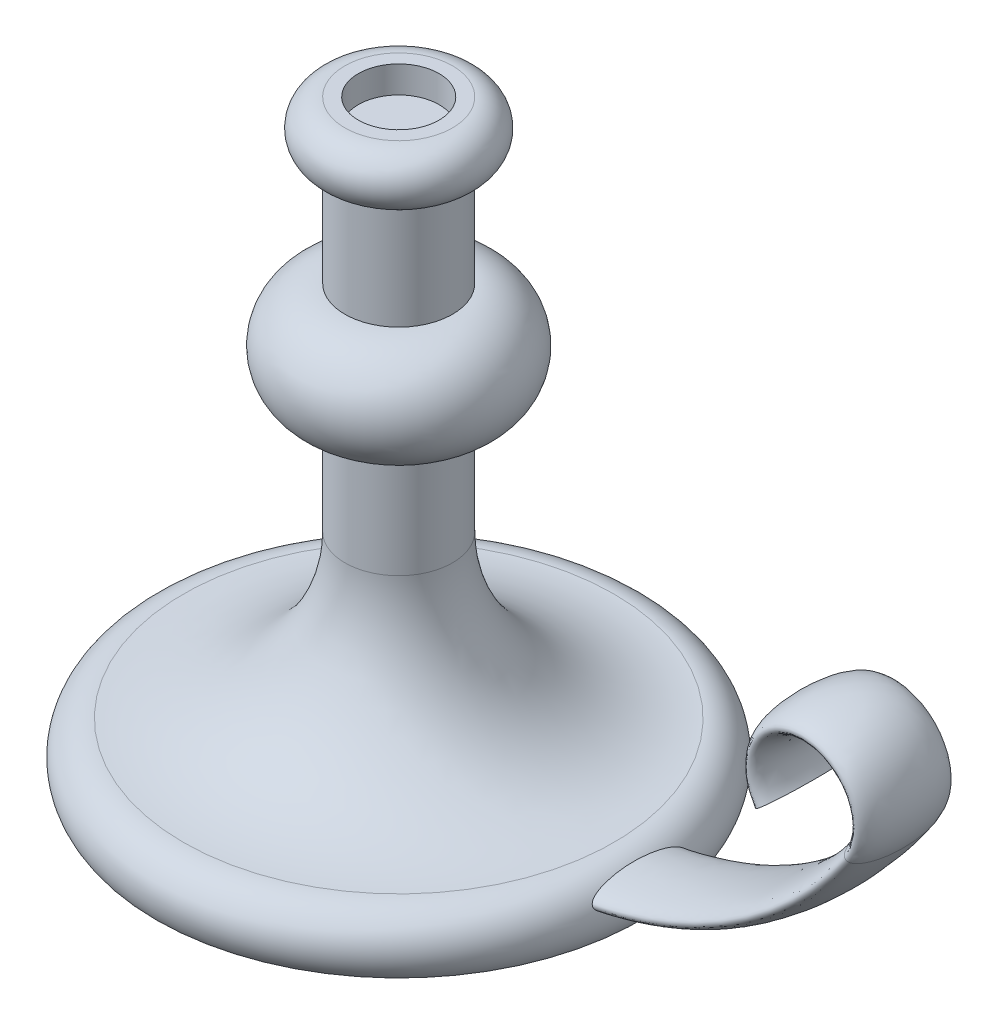
ISO-10303-21;
HEADER;
FILE_DESCRIPTION(('STEP AP214'),'2;1');
FILE_NAME('part.step','',(''),(''),'','','');
FILE_SCHEMA(('AUTOMOTIVE_DESIGN { 1 0 10303 214 1 1 1 1 }'));
ENDSEC;
DATA;
#1=APPLICATION_CONTEXT('core data for automotive mechanical design processes');
#2=APPLICATION_PROTOCOL_DEFINITION('international standard','automotive_design',2000,#1);
#3=PRODUCT_CONTEXT('',#1,'mechanical');
#4=PRODUCT('Part','Part','',(#3));
#5=PRODUCT_RELATED_PRODUCT_CATEGORY('part','',(#4));
#6=PRODUCT_DEFINITION_FORMATION('','',#4);
#7=PRODUCT_DEFINITION_CONTEXT('part definition',#1,'design');
#8=PRODUCT_DEFINITION('design','',#6,#7);
#9=PRODUCT_DEFINITION_SHAPE('','',#8);
#10=(LENGTH_UNIT() NAMED_UNIT(*) SI_UNIT(.MILLI.,.METRE.));
#11=(NAMED_UNIT(*) PLANE_ANGLE_UNIT() SI_UNIT($,.RADIAN.));
#12=(NAMED_UNIT(*) SI_UNIT($,.STERADIAN.) SOLID_ANGLE_UNIT());
#13=UNCERTAINTY_MEASURE_WITH_UNIT(LENGTH_MEASURE(1.E-05),#10,'distance_accuracy_value','');
#14=(GEOMETRIC_REPRESENTATION_CONTEXT(3) GLOBAL_UNCERTAINTY_ASSIGNED_CONTEXT((#13)) GLOBAL_UNIT_ASSIGNED_CONTEXT((#10,
#11,#12)) REPRESENTATION_CONTEXT('',''));
#15=CARTESIAN_POINT('',(0.,0.,0.));
#16=DIRECTION('',(0.,0.,1.));
#17=DIRECTION('',(1.,0.,0.));
#18=AXIS2_PLACEMENT_3D('',#15,#16,#17);
#19=CARTESIAN_POINT('',(0.,220.,0.));
#20=DIRECTION('',(0.,1.,0.));
#21=DIRECTION('',(0.,0.,1.));
#22=AXIS2_PLACEMENT_3D('',#19,#20,#21);
#23=PLANE('',#22);
#24=CARTESIAN_POINT('',(0.,220.,0.));
#25=DIRECTION('',(0.,1.,0.));
#26=DIRECTION('',(0.,0.,1.));
#27=AXIS2_PLACEMENT_3D('',#24,#25,#26);
#28=CIRCLE('',#27,15.);
#29=CARTESIAN_POINT('',(0.,220.,15.));
#30=VERTEX_POINT('',#29);
#31=EDGE_CURVE('E74',#30,#30,#28,.T.);
#32=ORIENTED_EDGE('',*,*,#31,.F.);
#33=EDGE_LOOP('',(#32));
#34=FACE_BOUND('',#33,.T.);
#35=CARTESIAN_POINT('',(0.,220.,0.));
#36=DIRECTION('',(0.,-1.,0.));
#37=DIRECTION('',(0.,0.,-1.));
#38=AXIS2_PLACEMENT_3D('',#35,#36,#37);
#39=CIRCLE('',#38,20.);
#40=CARTESIAN_POINT('',(0.,220.,-20.));
#41=VERTEX_POINT('',#40);
#42=EDGE_CURVE('E42',#41,#41,#39,.T.);
#43=ORIENTED_EDGE('',*,*,#42,.F.);
#44=EDGE_LOOP('',(#43));
#45=FACE_BOUND('',#44,.T.);
#46=ADVANCED_FACE('F31',(#34,#45),#23,.T.);
#47=CARTESIAN_POINT('',(0.,210.,0.));
#48=DIRECTION('',(0.,-1.,0.));
#49=DIRECTION('',(0.,0.,-1.));
#50=AXIS2_PLACEMENT_3D('',#47,#48,#49);
#51=TOROIDAL_SURFACE('',#50,20.,9.99999999999999);
#52=ORIENTED_EDGE('',*,*,#42,.T.);
#53=EDGE_LOOP('',(#52));
#54=FACE_BOUND('',#53,.T.);
#55=CARTESIAN_POINT('',(0.,200.,0.));
#56=DIRECTION('',(0.,-1.,0.));
#57=DIRECTION('',(0.,0.,-1.));
#58=AXIS2_PLACEMENT_3D('',#55,#56,#57);
#59=CIRCLE('',#58,20.);
#60=CARTESIAN_POINT('',(0.,200.,-20.));
#61=VERTEX_POINT('',#60);
#62=EDGE_CURVE('E46',#61,#61,#59,.T.);
#63=ORIENTED_EDGE('',*,*,#62,.F.);
#64=EDGE_LOOP('',(#63));
#65=FACE_BOUND('',#64,.T.);
#66=ADVANCED_FACE('F92',(#54,#65),#51,.T.);
#67=CARTESIAN_POINT('',(0.,0.,0.));
#68=DIRECTION('',(0.,-1.,0.));
#69=DIRECTION('',(0.,0.,-1.));
#70=AXIS2_PLACEMENT_3D('',#67,#68,#69);
#71=CYLINDRICAL_SURFACE('',#70,20.);
#72=ORIENTED_EDGE('',*,*,#62,.T.);
#73=EDGE_LOOP('',(#72));
#74=FACE_BOUND('',#73,.T.);
#75=CARTESIAN_POINT('',(0.,160.,0.));
#76=DIRECTION('',(0.,-1.,0.));
#77=DIRECTION('',(0.,0.,-1.));
#78=AXIS2_PLACEMENT_3D('',#75,#76,#77);
#79=CIRCLE('',#78,20.);
#80=CARTESIAN_POINT('',(0.,160.,-20.));
#81=VERTEX_POINT('',#80);
#82=EDGE_CURVE('E50',#81,#81,#79,.T.);
#83=ORIENTED_EDGE('',*,*,#82,.F.);
#84=EDGE_LOOP('',(#83));
#85=FACE_BOUND('',#84,.T.);
#86=ADVANCED_FACE('F96',(#74,#85),#71,.T.);
#87=CARTESIAN_POINT('',(0.,140.,0.));
#88=DIRECTION('',(0.,-1.,0.));
#89=DIRECTION('',(0.,0.,-1.));
#90=AXIS2_PLACEMENT_3D('',#87,#88,#89);
#91=DEGENERATE_TOROIDAL_SURFACE('',#90,20.,20.,.T.);
#92=ORIENTED_EDGE('',*,*,#82,.T.);
#93=EDGE_LOOP('',(#92));
#94=FACE_BOUND('',#93,.T.);
#95=CARTESIAN_POINT('',(0.,120.,0.));
#96=DIRECTION('',(0.,-1.,0.));
#97=DIRECTION('',(0.,0.,-1.));
#98=AXIS2_PLACEMENT_3D('',#95,#96,#97);
#99=CIRCLE('',#98,20.);
#100=CARTESIAN_POINT('',(0.,120.,-20.));
#101=VERTEX_POINT('',#100);
#102=EDGE_CURVE('E55',#101,#101,#99,.T.);
#103=ORIENTED_EDGE('',*,*,#102,.F.);
#104=EDGE_LOOP('',(#103));
#105=FACE_BOUND('',#104,.T.);
#106=ADVANCED_FACE('F100',(#94,#105),#91,.T.);
#107=CARTESIAN_POINT('',(0.,0.,0.));
#108=DIRECTION('',(0.,-1.,0.));
#109=DIRECTION('',(0.,0.,-1.));
#110=AXIS2_PLACEMENT_3D('',#107,#108,#109);
#111=CYLINDRICAL_SURFACE('',#110,20.);
#112=ORIENTED_EDGE('',*,*,#102,.T.);
#113=EDGE_LOOP('',(#112));
#114=FACE_BOUND('',#113,.T.);
#115=CARTESIAN_POINT('',(0.,80.,0.));
#116=DIRECTION('',(0.,-1.,0.));
#117=DIRECTION('',(0.,0.,-1.));
#118=AXIS2_PLACEMENT_3D('',#115,#116,#117);
#119=CIRCLE('',#118,20.);
#120=CARTESIAN_POINT('',(0.,80.,-20.));
#121=VERTEX_POINT('',#120);
#122=EDGE_CURVE('E58',#121,#121,#119,.T.);
#123=ORIENTED_EDGE('',*,*,#122,.F.);
#124=EDGE_LOOP('',(#123));
#125=FACE_BOUND('',#124,.T.);
#126=ADVANCED_FACE('F107',(#114,#125),#111,.T.);
#127=CARTESIAN_POINT('',(0.,80.,0.));
#128=DIRECTION('',(0.,-1.,0.));
#129=DIRECTION('',(0.,0.,-1.));
#130=AXIS2_PLACEMENT_3D('',#127,#128,#129);
#131=TOROIDAL_SURFACE('',#130,80.,60.);
#132=ORIENTED_EDGE('',*,*,#122,.T.);
#133=EDGE_LOOP('',(#132));
#134=FACE_BOUND('',#133,.T.);
#135=CARTESIAN_POINT('',(0.,20.,0.));
#136=DIRECTION('',(0.,-1.,0.));
#137=DIRECTION('',(0.,0.,-1.));
#138=AXIS2_PLACEMENT_3D('',#135,#136,#137);
#139=CIRCLE('',#138,80.);
#140=CARTESIAN_POINT('',(0.,20.,-80.));
#141=VERTEX_POINT('',#140);
#142=EDGE_CURVE('E61',#141,#141,#139,.T.);
#143=ORIENTED_EDGE('',*,*,#142,.F.);
#144=EDGE_LOOP('',(#143));
#145=FACE_BOUND('',#144,.T.);
#146=ADVANCED_FACE('F111',(#134,#145),#131,.F.);
#147=CARTESIAN_POINT('',(0.,7.50000000000001,0.));
#148=DIRECTION('',(0.,-1.,0.));
#149=DIRECTION('',(0.,0.,-1.));
#150=AXIS2_PLACEMENT_3D('',#147,#148,#149);
#151=TOROIDAL_SURFACE('',#150,80.,12.5);
#152=CARTESIAN_POINT('',(89.5597422043341,12.9414346567556,17.5));
#153=CARTESIAN_POINT('',(89.5807278946485,12.8988393157082,17.5000019534777));
#154=CARTESIAN_POINT('',(89.6018125795404,12.856303935777,17.4977816975197));
#155=CARTESIAN_POINT('',(89.6440155813562,12.7716938339371,17.4890025435431));
#156=CARTESIAN_POINT('',(89.6651339056646,12.7296192360718,17.4824425050804));
#157=CARTESIAN_POINT('',(89.7283289297819,12.6045076597418,17.4565216692095));
#158=CARTESIAN_POINT('',(89.7702246464785,12.5226255894255,17.4309204730636));
#159=CARTESIAN_POINT('',(89.8644276523311,12.3407735771966,17.3563532007827));
#160=CARTESIAN_POINT('',(89.9162117483189,12.242484901666,17.3027527423027));
#161=CARTESIAN_POINT('',(90.01638786814,12.0551458272009,17.178826321144));
#162=CARTESIAN_POINT('',(90.0647710548456,11.9661192269931,17.1084587296403));
#163=CARTESIAN_POINT('',(90.1524531790238,11.806984522925,16.9652391551481));
#164=CARTESIAN_POINT('',(90.1921458014335,11.7358878994479,16.8936963434586));
#165=CARTESIAN_POINT('',(90.2690886261224,11.5996259068225,16.7438969488311));
#166=CARTESIAN_POINT('',(90.3063367280021,11.5344656201533,16.665634722265));
#167=CARTESIAN_POINT('',(90.3786756485818,11.4092540815106,16.5039763875565));
#168=CARTESIAN_POINT('',(90.4137624747614,11.3492122106291,16.4205713158719));
#169=CARTESIAN_POINT('',(90.4819450166471,11.2336894025402,16.2499454917115));
#170=CARTESIAN_POINT('',(90.5150413047902,11.1782071523835,16.162725848809));
#171=CARTESIAN_POINT('',(90.5839705930101,11.063725182569,15.9728919395737));
#172=CARTESIAN_POINT('',(90.6195406839562,11.005315612885,15.8698282905888));
#173=CARTESIAN_POINT('',(90.6886668526269,10.8929143897208,15.6606649910659));
#174=CARTESIAN_POINT('',(90.7222226971281,10.8389232475745,15.5545649910507));
#175=CARTESIAN_POINT('',(90.7874864861339,10.7348751403119,15.3401290691865));
#176=CARTESIAN_POINT('',(90.8191972688173,10.6848120890841,15.2317969483068));
#177=CARTESIAN_POINT('',(90.881005962979,10.5880683385415,15.0131968985226));
#178=CARTESIAN_POINT('',(90.9111039714557,10.5413874357517,14.9029290865687));
#179=CARTESIAN_POINT('',(90.979897363352,10.4355491517099,14.6427529331227));
#180=CARTESIAN_POINT('',(91.0180072010883,10.3775936655761,14.4922012075482));
#181=CARTESIAN_POINT('',(91.0918875553169,10.2663462891692,14.1888070722872));
#182=CARTESIAN_POINT('',(91.1276577411367,10.2130550577559,14.0359643425399));
#183=CARTESIAN_POINT('',(91.1971197458645,10.1105127689612,13.7282685712582));
#184=CARTESIAN_POINT('',(91.2308091946811,10.0612662985099,13.5734134718711));
#185=CARTESIAN_POINT('',(91.2962483962877,9.96642044574803,13.2621801041721));
#186=CARTESIAN_POINT('',(91.3279980241889,9.92082129819997,13.1058017385397));
#187=CARTESIAN_POINT('',(91.4205951755326,9.78887458660802,12.6346162266686));
#188=CARTESIAN_POINT('',(91.4787589060981,9.70742476979599,12.3179025042443));
#189=CARTESIAN_POINT('',(91.5890957852253,9.55493826130157,11.6792188898603));
#190=CARTESIAN_POINT('',(91.6412365063819,9.48395741425911,11.3572303186111));
#191=CARTESIAN_POINT('',(91.7397682682944,9.35136221163202,10.7107316640824));
#192=CARTESIAN_POINT('',(91.7861636672357,9.28974074823251,10.3862236929836));
#193=CARTESIAN_POINT('',(91.873697660451,9.17463718318058,9.73512886653587));
#194=CARTESIAN_POINT('',(91.9148370779327,9.12115380666541,9.40854234516834));
#195=CARTESIAN_POINT('',(91.9930777751442,9.02031209920322,8.74630339912633));
#196=CARTESIAN_POINT('',(92.0300669877613,8.97311921137164,8.41061269264357));
#197=CARTESIAN_POINT('',(92.0991833927575,8.88559842477438,7.73783252743965));
#198=CARTESIAN_POINT('',(92.1313104056235,8.84527077946755,7.40074301754631));
#199=CARTESIAN_POINT('',(92.1909161961866,8.77092313439273,6.72537142355366));
#200=CARTESIAN_POINT('',(92.2183937480205,8.73690479789187,6.38708904887212));
#201=CARTESIAN_POINT('',(92.2688480816039,8.67476840304506,5.70964427774312));
#202=CARTESIAN_POINT('',(92.2918247141674,8.64665054027197,5.37048185250321));
#203=CARTESIAN_POINT('',(92.3540877228586,8.5707660463049,4.35367181244691));
#204=CARTESIAN_POINT('',(92.3868571977359,8.53128338370558,3.67498389641669));
#205=CARTESIAN_POINT('',(92.4356134743347,8.47274161832899,2.31614711504093));
#206=CARTESIAN_POINT('',(92.4515998737813,8.45368300509718,1.63599821506847));
#207=CARTESIAN_POINT('',(92.4661200478781,8.43637339284856,0.357955102332151));
#208=CARTESIAN_POINT('',(92.4665389208555,8.43587490179709,-0.239888856143484));
#209=CARTESIAN_POINT('',(92.4546362797528,8.45006241260832,-1.43536153859154));
#210=CARTESIAN_POINT('',(92.4423128974783,8.46475064105848,-2.03299021814835));
#211=CARTESIAN_POINT('',(92.4047541650815,8.50976680779932,-3.22745109478543));
#212=CARTESIAN_POINT('',(92.3795147316879,8.5400996920044,-3.82428298010727));
#213=CARTESIAN_POINT('',(92.3157217367252,8.61743320229679,-5.0169460623327));
#214=CARTESIAN_POINT('',(92.2771508465328,8.66445552395923,-5.61277493756143));
#215=CARTESIAN_POINT('',(92.1861026743767,8.77678784246261,-6.8015388638096));
#216=CARTESIAN_POINT('',(92.1336290020918,8.84209309262505,-7.39447462535114));
#217=CARTESIAN_POINT('',(92.0437550848418,8.95574227206717,-8.28055229820542));
#218=CARTESIAN_POINT('',(92.0119455213755,8.9962289455202,-8.57528682166757));
#219=CARTESIAN_POINT('',(91.9444204496404,9.08291539794895,-9.16346094428918));
#220=CARTESIAN_POINT('',(91.9087051114864,9.12911492811466,-9.45690059926749));
#221=CARTESIAN_POINT('',(91.8331309715697,9.22782929334077,-10.0422906036687));
#222=CARTESIAN_POINT('',(91.7932707518513,9.28034629056392,-10.3342404073472));
#223=CARTESIAN_POINT('',(91.7091179167369,9.39245062081641,-10.9161852811057));
#224=CARTESIAN_POINT('',(91.6648247441271,9.45203884286041,-11.2061801005457));
#225=CARTESIAN_POINT('',(91.571392572748,9.57931645333893,-11.7838191658173));
#226=CARTESIAN_POINT('',(91.5222504482681,9.6470110733694,-12.0714617643077));
#227=CARTESIAN_POINT('',(91.4186796874405,9.79172730085923,-12.6430805537637));
#228=CARTESIAN_POINT('',(91.3642572573634,9.86873798424112,-12.927060615036));
#229=CARTESIAN_POINT('',(91.2493765391173,10.0339529747882,-13.4904217181471));
#230=CARTESIAN_POINT('',(91.1889212109096,10.1221517983456,-13.7698049377454));
#231=CARTESIAN_POINT('',(91.0929373870872,10.2648274882365,-14.1839125047652));
#232=CARTESIAN_POINT('',(91.060075748626,10.3140904181852,-14.3210581267392));
#233=CARTESIAN_POINT('',(90.9923938569384,10.4165511027194,-14.5933763477655));
#234=CARTESIAN_POINT('',(90.9575737807134,10.4697485018486,-14.728549123735));
#235=CARTESIAN_POINT('',(90.8810851838775,10.5878451344082,-15.0138774923683));
#236=CARTESIAN_POINT('',(90.8391147723955,10.6533666208414,-15.1636969104753));
#237=CARTESIAN_POINT('',(90.7519625692611,10.7912189771817,-15.4593295355904));
#238=CARTESIAN_POINT('',(90.7067794219567,10.8635527258309,-15.6051410149852));
#239=CARTESIAN_POINT('',(90.6128939496974,11.0160439629678,-15.8905749729624));
#240=CARTESIAN_POINT('',(90.564208454431,11.0961646105686,-16.0302224467126));
#241=CARTESIAN_POINT('',(90.4624897667354,11.2662530107872,-16.3016394850687));
#242=CARTESIAN_POINT('',(90.4094613083908,11.3562100760681,-16.4334173639363));
#243=CARTESIAN_POINT('',(90.3114276481006,11.5255085385047,-16.6553108138958));
#244=CARTESIAN_POINT('',(90.2675273757817,11.6022608890605,-16.7478644471359));
#245=CARTESIAN_POINT('',(90.1761749534326,11.7643292238686,-16.9236630994731));
#246=CARTESIAN_POINT('',(90.1287172073378,11.849658775493,-17.0068929161981));
#247=CARTESIAN_POINT('',(90.0292807633425,12.0313291797369,-17.160728121925));
#248=CARTESIAN_POINT('',(89.9772518064337,12.1277974407355,-17.2311575389092));
#249=CARTESIAN_POINT('',(89.8965437818877,12.2800613987943,-17.3212876850736));
#250=CARTESIAN_POINT('',(89.8692277989252,12.3320164153138,-17.3487242132162));
#251=CARTESIAN_POINT('',(89.813832031143,12.438295516848,-17.397521114568));
#252=CARTESIAN_POINT('',(89.7857527202501,12.4926181439801,-17.4188851676712));
#253=CARTESIAN_POINT('',(89.7185869780335,12.6237048005601,-17.4611772226904));
#254=CARTESIAN_POINT('',(89.6792533408885,12.7013692224279,-17.4790502108364));
#255=CARTESIAN_POINT('',(89.6005512815563,12.8586256339487,-17.4997317533413));
#256=CARTESIAN_POINT('',(89.5611829132232,12.9382160139951,-17.5025524785485));
#257=CARTESIAN_POINT('',(89.4835317885695,13.0969633423246,-17.4927372657774));
#258=CARTESIAN_POINT('',(89.4452490812935,13.1761202708966,-17.48010063065));
#259=CARTESIAN_POINT('',(89.3707047667354,13.3318071774565,-17.440649407729));
#260=CARTESIAN_POINT('',(89.334445299377,13.4083343423533,-17.4138201116179));
#261=CARTESIAN_POINT('',(89.2510611220234,13.5858554385685,-17.3357126521071));
#262=CARTESIAN_POINT('',(89.205099865083,13.6849823777222,-17.279004762084));
#263=CARTESIAN_POINT('',(89.1180744174555,13.8744276311822,-17.1491670423825));
#264=CARTESIAN_POINT('',(89.0770301058259,13.9647099356689,-17.0759737821297));
#265=CARTESIAN_POINT('',(89.0037033744711,14.1271434857574,-16.9270577307037));
#266=CARTESIAN_POINT('',(88.9709541551902,14.2001945680735,-16.8525208708984));
#267=CARTESIAN_POINT('',(88.9084968426189,14.3401811690452,-16.6970292692108));
#268=CARTESIAN_POINT('',(88.8787841266132,14.4071259665772,-16.6160846261889));
#269=CARTESIAN_POINT('',(88.8217814388547,14.5359995630886,-16.4490709627674));
#270=CARTESIAN_POINT('',(88.7944998605825,14.5979109242415,-16.3629857823206));
#271=CARTESIAN_POINT('',(88.7420667437368,14.7171734064664,-16.1870697873627));
#272=CARTESIAN_POINT('',(88.7169159331091,14.7745229686605,-16.0972377082946));
#273=CARTESIAN_POINT('',(88.6682699235335,14.8855899090516,-15.9140699306457));
#274=CARTESIAN_POINT('',(88.6447869137154,14.939280448943,-15.8207148279053));
#275=CARTESIAN_POINT('',(88.5993971939425,15.0431008843886,-15.6316626961426));
#276=CARTESIAN_POINT('',(88.5774907604156,15.0932301555106,-15.5359652603517));
#277=CARTESIAN_POINT('',(88.5137514786218,15.239028587419,-15.2458062448779));
#278=CARTESIAN_POINT('',(88.4739596847911,15.3299685477364,-15.0485147207838));
#279=CARTESIAN_POINT('',(88.3985337506612,15.5017775203631,-14.6487152633377));
#280=CARTESIAN_POINT('',(88.3629029634837,15.5826384140045,-14.4462032813462));
#281=CARTESIAN_POINT('',(88.2948356711209,15.7363066128677,-14.0365764701676));
#282=CARTESIAN_POINT('',(88.2624142295167,15.8090761199822,-13.8294450545336));
#283=CARTESIAN_POINT('',(88.2003835751379,15.9473648801962,-13.4126289871744));
#284=CARTESIAN_POINT('',(88.1707714189811,16.0128917338228,-13.2029472733565));
#285=CARTESIAN_POINT('',(88.1139049361935,16.1377375745627,-12.7814949946282));
#286=CARTESIAN_POINT('',(88.0866500408506,16.197058059751,-12.5697249473608));
#287=CARTESIAN_POINT('',(88.0276172572028,16.3244235662312,-12.0912931700755));
#288=CARTESIAN_POINT('',(87.9964138193042,16.3909381265501,-11.824154050232));
#289=CARTESIAN_POINT('',(87.9367717636614,16.5165936764726,-11.2878278414623));
#290=CARTESIAN_POINT('',(87.9083334164418,16.5757339447667,-11.0186405549246));
#291=CARTESIAN_POINT('',(87.8539266282969,16.6875098948963,-10.4785408424853));
#292=CARTESIAN_POINT('',(87.8279593730484,16.7401424578001,-10.2076276543162));
#293=CARTESIAN_POINT('',(87.7783184309328,16.8395301522943,-9.66451167999494));
#294=CARTESIAN_POINT('',(87.7546448506393,16.8862850108124,-9.39230883453579));
#295=CARTESIAN_POINT('',(87.6869994555322,17.0182803050954,-8.57578965921412));
#296=CARTESIAN_POINT('',(87.6462388525843,17.0955854003693,-8.02991167225055));
#297=CARTESIAN_POINT('',(87.5728065515608,17.2320145687308,-6.93552385093559));
#298=CARTESIAN_POINT('',(87.540133067568,17.2911426566333,-6.38701462497626));
#299=CARTESIAN_POINT('',(87.4828441952968,17.3930876120979,-5.28955884850399));
#300=CARTESIAN_POINT('',(87.4582074588678,17.4359477429327,-4.74061740412031));
#301=CARTESIAN_POINT('',(87.416941099917,17.5068884934705,-3.6414610821818));
#302=CARTESIAN_POINT('',(87.40031190886,17.5349683167842,-3.09124613761253));
#303=CARTESIAN_POINT('',(87.3751699481988,17.5771566462027,-1.98980868968643));
#304=CARTESIAN_POINT('',(87.3666614689742,17.5912577671533,-1.43858580771537));
#305=CARTESIAN_POINT('',(87.3578539704595,17.6058511840596,-0.335909067639317));
#306=CARTESIAN_POINT('',(87.3575547550007,17.6063438052041,0.215544784631499));
#307=CARTESIAN_POINT('',(87.3651677510509,17.5937352162512,1.31815822776897));
#308=CARTESIAN_POINT('',(87.3730787250644,17.5806360547994,1.86931785045765));
#309=CARTESIAN_POINT('',(87.3970372477744,17.5404868292743,2.97097544678431));
#310=CARTESIAN_POINT('',(87.413085065354,17.5134363041756,3.52147339795463));
#311=CARTESIAN_POINT('',(87.4531996813085,17.444621382757,4.62112135667553));
#312=CARTESIAN_POINT('',(87.4772644593795,17.4028606933013,5.17027166874922));
#313=CARTESIAN_POINT('',(87.5333316774065,17.3033707612723,6.26670053624347));
#314=CARTESIAN_POINT('',(87.5653334299487,17.2456429015507,6.81397924960214));
#315=CARTESIAN_POINT('',(87.6208220531237,17.1429049509074,7.65503321384591));
#316=CARTESIAN_POINT('',(87.6414679669266,17.104233324673,7.94978028809696));
#317=CARTESIAN_POINT('',(87.6851649593462,17.0212250701543,8.5382946276299));
#318=CARTESIAN_POINT('',(87.7082159678756,16.9768886069416,8.83206192120645));
#319=CARTESIAN_POINT('',(87.7568106691343,16.8820510369668,9.41827197237593));
#320=CARTESIAN_POINT('',(87.7823533406007,16.8315524537733,9.7107152216552));
#321=CARTESIAN_POINT('',(87.8360989952271,16.7237193681037,10.2940938312815));
#322=CARTESIAN_POINT('',(87.8643018909563,16.6663850902729,10.5850292408538));
#323=CARTESIAN_POINT('',(87.9147712499553,16.5622842610492,11.0784529887283));
#324=CARTESIAN_POINT('',(87.936298025296,16.5174691899777,11.2814293835392));
#325=CARTESIAN_POINT('',(87.980911830131,16.4236835134739,11.686245562313));
#326=CARTESIAN_POINT('',(88.0039988123359,16.374713033979,11.8880853805244));
#327=CARTESIAN_POINT('',(88.0519198244949,16.2721215384747,12.2905621648893));
#328=CARTESIAN_POINT('',(88.0767553337329,16.2184965755417,12.4911979528461));
#329=CARTESIAN_POINT('',(88.1283787004673,16.1060707847327,12.8907612736882));
#330=CARTESIAN_POINT('',(88.1551664933029,16.0472701282652,13.0896888629063));
#331=CARTESIAN_POINT('',(88.210999978051,15.9237718205564,13.4854201231451));
#332=CARTESIAN_POINT('',(88.2400459194864,15.8590735174952,13.6822235567049));
#333=CARTESIAN_POINT('',(88.3008027999438,15.7228691935839,14.0730419872934));
#334=CARTESIAN_POINT('',(88.332513477959,15.651363839383,14.2670572552438));
#335=CARTESIAN_POINT('',(88.3991424541966,15.5003948115845,14.6511973591173));
#336=CARTESIAN_POINT('',(88.4340575115823,15.4209391715411,14.8413258930696));
#337=CARTESIAN_POINT('',(88.5079196083055,15.252384876255,15.2164401400203));
#338=CARTESIAN_POINT('',(88.5468648114136,15.1632906117633,15.4014281468524));
#339=CARTESIAN_POINT('',(88.6092096238858,15.0206579718854,15.6733114229673));
#340=CARTESIAN_POINT('',(88.6306485895108,14.971608674001,15.7630166800399));
#341=CARTESIAN_POINT('',(88.6750422753318,14.8701248615208,15.9401002079397));
#342=CARTESIAN_POINT('',(88.6979967332502,14.8176909327186,16.027478877762));
#343=CARTESIAN_POINT('',(88.7456840101804,14.7089478844263,16.1993887567151));
#344=CARTESIAN_POINT('',(88.7704179688275,14.6526362825882,16.2839180892558));
#345=CARTESIAN_POINT('',(88.8219484857483,14.5356422617896,16.4492391224765));
#346=CARTESIAN_POINT('',(88.848744534505,14.4749609227737,16.530031738604));
#347=CARTESIAN_POINT('',(88.897610278819,14.3647434848942,16.6667168433058));
#348=CARTESIAN_POINT('',(88.9191374191613,14.3163230322073,16.7236955334953));
#349=CARTESIAN_POINT('',(88.9637080676472,14.2164452982151,16.8342912802682));
#350=CARTESIAN_POINT('',(88.9867519478517,14.1649872721055,16.8879075056825));
#351=CARTESIAN_POINT('',(89.0583610181505,14.0058008216788,17.0423310846563));
#352=CARTESIAN_POINT('',(89.1095289234109,13.8929758416947,17.1370796109732));
#353=CARTESIAN_POINT('',(89.1999001554579,13.6963386208964,17.2707956184671));
#354=CARTESIAN_POINT('',(89.2367505169326,13.6167644879672,17.3175503480636));
#355=CARTESIAN_POINT('',(89.3136877653856,13.4522974166001,17.396846873719));
#356=CARTESIAN_POINT('',(89.3537667767873,13.3674175273956,17.4294220837185));
#357=CARTESIAN_POINT('',(89.4217091217898,13.2251848973534,17.4685967336685));
#358=CARTESIAN_POINT('',(89.4488093840983,13.168855171617,17.4803204652977));
#359=CARTESIAN_POINT('',(89.503794774035,13.0554594934968,17.4960211898048));
#360=CARTESIAN_POINT('',(89.5316799819,12.998393466174,17.499997387795));
#361=CARTESIAN_POINT('',(89.5597422043341,12.9414346567556,17.5));
#362=B_SPLINE_CURVE_WITH_KNOTS('',3,(#152,#153,#154,#155,#156,#157,#158,#159,#160,#161,#162,
#163,#164,#165,#166,#167,#168,#169,#170,#171,#172,#173,#174,#175,#176,#177,#178,#179,#180,#181,
#182,#183,#184,#185,#186,#187,#188,#189,#190,#191,#192,#193,#194,#195,#196,#197,#198,#199,#200,
#201,#202,#203,#204,#205,#206,#207,#208,#209,#210,#211,#212,#213,#214,#215,#216,#217,#218,#219,
#220,#221,#222,#223,#224,#225,#226,#227,#228,#229,#230,#231,#232,#233,#234,#235,#236,#237,#238,
#239,#240,#241,#242,#243,#244,#245,#246,#247,#248,#249,#250,#251,#252,#253,#254,#255,#256,#257,
#258,#259,#260,#261,#262,#263,#264,#265,#266,#267,#268,#269,#270,#271,#272,#273,#274,#275,#276,
#277,#278,#279,#280,#281,#282,#283,#284,#285,#286,#287,#288,#289,#290,#291,#292,#293,#294,#295,
#296,#297,#298,#299,#300,#301,#302,#303,#304,#305,#306,#307,#308,#309,#310,#311,#312,#313,#314,
#315,#316,#317,#318,#319,#320,#321,#322,#323,#324,#325,#326,#327,#328,#329,#330,#331,#332,#333,
#334,#335,#336,#337,#338,#339,#340,#341,#342,#343,#344,#345,#346,#347,#348,#349,#350,#351,#352,
#353,#354,#355,#356,#357,#358,#359,#360,#361),.UNSPECIFIED.,.T.,.F.,(4,2,2,2,2,2,2,2,2,2,2,2,2,
2,2,2,2,2,2,2,2,2,2,2,2,2,2,2,2,2,2,2,2,2,2,2,2,2,2,2,2,2,2,2,2,2,2,2,2,2,2,2,2,2,2,2,2,2,2,2,2,
2,2,2,2,2,2,2,2,2,2,2,2,2,2,2,2,2,2,2,2,2,2,2,2,2,2,2,2,2,2,2,2,2,2,2,2,2,2,2,2,2,2,2,4),(0.,
0.142381357158828,0.284800145338824,0.569778369710421,0.937790990160535,1.30672699797603,
1.63143353328554,1.95641550824171,2.28198085179476,2.60745211744529,2.97835758825746,
3.3493059225314,3.71966767593572,4.09000712931061,4.58717127025773,5.08440552627598,
5.58219609730415,6.08001868322199,7.07612740491141,8.07737111401408,9.07785060328466,
10.0781732018628,11.1010679437461,12.1240004418368,13.1472022244406,14.1704379160041,
16.2117115539472,18.2530341182271,20.0462457692418,21.8397203676841,23.6337623045228,
25.4301450150667,27.2260617741978,28.1235892294181,29.0210776087008,29.9188740333852,
30.8167834514327,31.7152755049927,32.6127240115724,33.5097343419011,33.9578247270822,
34.4058746792336,34.9121604747943,35.4186611861172,35.9228725276492,36.4265413835617,
36.8100240505595,37.19412315042,37.5831580539594,37.7772586450044,37.9712413599171,
38.236625814232,38.5017956533803,38.7669774525073,39.0324346081151,39.3996555983552,
39.7683144393125,40.0959866375244,40.4231523204134,40.7514069982219,41.0797733710084,
41.4103344436388,41.7409533344663,42.4030339566283,43.0656444835748,43.7312306850969,
44.3961116446175,45.0608317450526,45.8918608553104,46.7229711882529,47.5544783139788,
48.3860240564184,50.0440426041216,51.7016946763057,53.3549069476237,55.0082082878508,
56.6623826267396,58.3165174374246,59.9704029618994,61.624343142828,63.2778668395718,
64.9312473761757,65.825161771749,66.7190501248769,67.6125736254281,68.50606776969,
69.1329546330725,69.7598225042348,70.3872272415141,71.0146112082258,71.6420645989557,
72.26945660307,72.896220926349,73.5227009279553,73.8360175198424,74.1492800292323,
74.4627449766613,74.7761327179504,75.0094189443203,75.2427626113355,75.7080186392232,
76.0052441465126,76.3017654013253,76.4921392885525,76.6825327068869),.UNSPECIFIED.);
#363=CARTESIAN_POINT('',(89.5597422043341,12.9414346567556,17.5));
#364=VERTEX_POINT('',#363);
#365=EDGE_CURVE('E10',#364,#364,#362,.T.);
#366=ORIENTED_EDGE('',*,*,#365,.F.);
#367=EDGE_LOOP('',(#366));
#368=FACE_BOUND('',#367,.T.);
#369=ORIENTED_EDGE('',*,*,#142,.T.);
#370=EDGE_LOOP('',(#369));
#371=FACE_BOUND('',#370,.T.);
#372=CARTESIAN_POINT('',(0.,0.,0.));
#373=DIRECTION('',(0.,-1.,0.));
#374=DIRECTION('',(0.,0.,-1.));
#375=AXIS2_PLACEMENT_3D('',#372,#373,#374);
#376=CIRCLE('',#375,90.);
#377=CARTESIAN_POINT('',(0.,0.,-90.));
#378=VERTEX_POINT('',#377);
#379=EDGE_CURVE('E64',#378,#378,#376,.T.);
#380=ORIENTED_EDGE('',*,*,#379,.F.);
#381=EDGE_LOOP('',(#380));
#382=FACE_BOUND('',#381,.T.);
#383=ADVANCED_FACE('F114',(#368,#371,#382),#151,.T.);
#384=CARTESIAN_POINT('',(0.,0.,0.));
#385=DIRECTION('',(0.,-1.,0.));
#386=DIRECTION('',(0.,0.,-1.));
#387=AXIS2_PLACEMENT_3D('',#384,#385,#386);
#388=PLANE('',#387);
#389=ORIENTED_EDGE('',*,*,#379,.T.);
#390=EDGE_LOOP('',(#389));
#391=FACE_BOUND('',#390,.T.);
#392=ADVANCED_FACE('F119',(#391),#388,.T.);
#393=CARTESIAN_POINT('',(150.634185358261,75.,0.));
#394=DIRECTION('',(0.566666666666667,-0.823947139620552,0.));
#395=DIRECTION('',(0.,0.,-1.));
#396=AXIS2_PLACEMENT_3D('',#393,#394,#395);
#397=PLANE('',#396);
#398=CARTESIAN_POINT('',(150.634185358261,75.,0.));
#399=DIRECTION('',(0.566666666666667,-0.823947139620552,0.));
#400=DIRECTION('',(0.,0.,1.));
#401=AXIS2_PLACEMENT_3D('',#398,#399,#400);
#402=ELLIPSE('',#401,17.5,5.);
#403=CARTESIAN_POINT('',(150.634185358261,75.,17.5));
#404=VERTEX_POINT('',#403);
#405=EDGE_CURVE('E67',#404,#404,#402,.T.);
#406=ORIENTED_EDGE('',*,*,#405,.T.);
#407=EDGE_LOOP('',(#406));
#408=FACE_BOUND('',#407,.T.);
#409=ADVANCED_FACE('F87',(#408),#397,.T.);
#410=CARTESIAN_POINT('',(60.,10.,17.5));
#411=CARTESIAN_POINT('',(110.410191303973,10.,17.5));
#412=CARTESIAN_POINT('',(155.026295870831,33.4646670673665,17.5));
#413=CARTESIAN_POINT('',(183.592070943083,75.,17.5));
#414=CARTESIAN_POINT('',(60.,0.,17.5));
#415=CARTESIAN_POINT('',(113.770870724238,0.,17.5));
#416=CARTESIAN_POINT('',(161.36138226222,25.0289782051909,17.5));
#417=CARTESIAN_POINT('',(191.831542339288,69.3333333333333,17.5));
#418=CARTESIAN_POINT('',(60.,0.,-17.5));
#419=CARTESIAN_POINT('',(113.770870724238,0.,-17.5));
#420=CARTESIAN_POINT('',(161.36138226222,25.0289782051909,-17.5));
#421=CARTESIAN_POINT('',(191.831542339288,69.3333333333333,-17.5));
#422=CARTESIAN_POINT('',(60.,10.,-17.5));
#423=CARTESIAN_POINT('',(110.410191303973,10.,-17.5));
#424=CARTESIAN_POINT('',(155.026295870831,33.4646670673665,-17.5));
#425=CARTESIAN_POINT('',(183.592070943083,75.,-17.5));
#426=CARTESIAN_POINT('',(60.,20.,-17.5));
#427=CARTESIAN_POINT('',(107.049511883708,20.,-17.5));
#428=CARTESIAN_POINT('',(148.691209479442,41.9003559295421,-17.5));
#429=CARTESIAN_POINT('',(175.352599546877,80.6666666666667,-17.5));
#430=CARTESIAN_POINT('',(60.,20.,17.5));
#431=CARTESIAN_POINT('',(107.049511883708,20.,17.5));
#432=CARTESIAN_POINT('',(148.691209479442,41.9003559295421,17.5));
#433=CARTESIAN_POINT('',(175.352599546877,80.6666666666667,17.5));
#434=CARTESIAN_POINT('',(60.,10.,17.5));
#435=CARTESIAN_POINT('',(110.410191303973,10.,17.5));
#436=CARTESIAN_POINT('',(155.026295870831,33.4646670673665,17.5));
#437=CARTESIAN_POINT('',(183.592070943083,75.,17.5));
#438=(BOUNDED_SURFACE() B_SPLINE_SURFACE(3,3,((#410,#411,#412,#413),(#414,#415,#416,#417),(#418,
#419,#420,#421),(#422,#423,#424,#425),(#426,#427,#428,#429),(#430,#431,#432,#433),(#434,#435,
#436,#437)),.UNSPECIFIED.,.T.,.F.,.F.) B_SPLINE_SURFACE_WITH_KNOTS((4,3,4),(4,4),(0.,0.5,1.),
(0.,1.),.UNSPECIFIED.) GEOMETRIC_REPRESENTATION_ITEM() RATIONAL_B_SPLINE_SURFACE(((1.,
0.923374135437856,0.923374135437856,1.),(0.333333333333333,0.307791378479285,0.307791378479285,
0.333333333333333),(0.333333333333333,0.307791378479285,0.307791378479285,0.333333333333333),
(1.,0.923374135437856,0.923374135437856,1.),(0.333333333333333,0.307791378479285,
0.307791378479285,0.333333333333333),(0.333333333333333,0.307791378479285,0.307791378479285,
0.333333333333333),(1.,0.923374135437856,0.923374135437856,1.))) REPRESENTATION_ITEM('') SURFACE());
#439=CARTESIAN_POINT('',(183.592070943083,75.,0.));
#440=DIRECTION('',(0.566666666666667,0.823947139620552,0.));
#441=DIRECTION('',(0.,0.,1.));
#442=AXIS2_PLACEMENT_3D('',#439,#440,#441);
#443=ELLIPSE('',#442,17.5,5.);
#444=CARTESIAN_POINT('',(183.592070943083,75.,17.5));
#445=VERTEX_POINT('',#444);
#446=EDGE_CURVE('E70',#445,#445,#443,.T.);
#447=ORIENTED_EDGE('',*,*,#365,.T.);
#448=EDGE_LOOP('',(#447));
#449=FACE_BOUND('',#448,.T.);
#450=ORIENTED_EDGE('',*,*,#446,.F.);
#451=EDGE_LOOP('',(#450));
#452=FACE_BOUND('',#451,.T.);
#453=ADVANCED_FACE('F126',(#449,#452),#438,.T.);
#454=CARTESIAN_POINT('',(183.592070943083,75.,17.5));
#455=CARTESIAN_POINT('',(193.981461744242,90.1064273523801,17.5));
#456=CARTESIAN_POINT('',(185.447347211541,106.333333333333,17.5));
#457=CARTESIAN_POINT('',(167.113128150672,106.333333333333,17.5));
#458=CARTESIAN_POINT('',(148.778909089802,106.333333333333,17.5));
#459=CARTESIAN_POINT('',(140.244794557101,90.1064273523801,17.5));
#460=CARTESIAN_POINT('',(150.634185358261,75.,17.5));
#461=CARTESIAN_POINT('',(191.831542339288,69.3333333333333,17.5));
#462=CARTESIAN_POINT('',(207.415628541027,91.9929743619034,17.5));
#463=CARTESIAN_POINT('',(194.614456741976,116.333333333333,17.5));
#464=CARTESIAN_POINT('',(167.113128150672,116.333333333333,17.5));
#465=CARTESIAN_POINT('',(139.611799559367,116.333333333333,17.5));
#466=CARTESIAN_POINT('',(126.810627760316,91.9929743619034,17.5));
#467=CARTESIAN_POINT('',(142.394713962055,69.3333333333333,17.5));
#468=CARTESIAN_POINT('',(191.831542339288,69.3333333333333,-17.5));
#469=CARTESIAN_POINT('',(207.415628541027,91.9929743619034,-17.5));
#470=CARTESIAN_POINT('',(194.614456741976,116.333333333333,-17.5));
#471=CARTESIAN_POINT('',(167.113128150672,116.333333333333,-17.5));
#472=CARTESIAN_POINT('',(139.611799559367,116.333333333333,-17.5));
#473=CARTESIAN_POINT('',(126.810627760316,91.9929743619034,-17.5));
#474=CARTESIAN_POINT('',(142.394713962055,69.3333333333333,-17.5));
#475=CARTESIAN_POINT('',(183.592070943083,75.,-17.5));
#476=CARTESIAN_POINT('',(193.981461744242,90.1064273523801,-17.5));
#477=CARTESIAN_POINT('',(185.447347211541,106.333333333333,-17.5));
#478=CARTESIAN_POINT('',(167.113128150672,106.333333333333,-17.5));
#479=CARTESIAN_POINT('',(148.778909089802,106.333333333333,-17.5));
#480=CARTESIAN_POINT('',(140.244794557101,90.1064273523801,-17.5));
#481=CARTESIAN_POINT('',(150.634185358261,75.,-17.5));
#482=CARTESIAN_POINT('',(175.352599546877,80.6666666666667,-17.5));
#483=CARTESIAN_POINT('',(180.547294947457,88.2198803428567,-17.5));
#484=CARTESIAN_POINT('',(176.280237681106,96.3333333333334,-17.5));
#485=CARTESIAN_POINT('',(167.113128150672,96.3333333333333,-17.5));
#486=CARTESIAN_POINT('',(157.946018620237,96.3333333333332,-17.5));
#487=CARTESIAN_POINT('',(153.678961353886,88.2198803428566,-17.5));
#488=CARTESIAN_POINT('',(158.873656754466,80.6666666666666,-17.5));
#489=CARTESIAN_POINT('',(175.352599546877,80.6666666666667,17.5));
#490=CARTESIAN_POINT('',(180.547294947457,88.2198803428567,17.5));
#491=CARTESIAN_POINT('',(176.280237681106,96.3333333333334,17.5));
#492=CARTESIAN_POINT('',(167.113128150672,96.3333333333333,17.5));
#493=CARTESIAN_POINT('',(157.946018620237,96.3333333333332,17.5));
#494=CARTESIAN_POINT('',(153.678961353886,88.2198803428566,17.5));
#495=CARTESIAN_POINT('',(158.873656754466,80.6666666666666,17.5));
#496=CARTESIAN_POINT('',(183.592070943083,75.,17.5));
#497=CARTESIAN_POINT('',(193.981461744242,90.1064273523801,17.5));
#498=CARTESIAN_POINT('',(185.447347211541,106.333333333333,17.5));
#499=CARTESIAN_POINT('',(167.113128150672,106.333333333333,17.5));
#500=CARTESIAN_POINT('',(148.778909089802,106.333333333333,17.5));
#501=CARTESIAN_POINT('',(140.244794557101,90.1064273523801,17.5));
#502=CARTESIAN_POINT('',(150.634185358261,75.,17.5));
#503=(BOUNDED_SURFACE() B_SPLINE_SURFACE(3,3,((#454,#455,#456,#457,#458,#459,#460),(#461,#462,
#463,#464,#465,#466,#467),(#468,#469,#470,#471,#472,#473,#474),(#475,#476,#477,#478,#479,#480,
#481),(#482,#483,#484,#485,#486,#487,#488),(#489,#490,#491,#492,#493,#494,#495),(#496,#497,#498,
#499,#500,#501,#502)),.UNSPECIFIED.,.T.,.F.,.F.) B_SPLINE_SURFACE_WITH_KNOTS((4,3,4),(4,3,4),
(0.,0.5,1.),(0.,0.5,1.),
.UNSPECIFIED.) GEOMETRIC_REPRESENTATION_ITEM() RATIONAL_B_SPLINE_SURFACE(((1.,0.643649778750421,
0.643649778750421,1.,0.643649778750421,0.643649778750421,1.),(0.333333333333333,
0.21454992625014,0.21454992625014,0.333333333333333,0.21454992625014,0.21454992625014,
0.333333333333333),(0.333333333333333,0.21454992625014,0.21454992625014,0.333333333333333,
0.21454992625014,0.21454992625014,0.333333333333333),(1.,0.643649778750421,0.643649778750421,1.,
0.643649778750421,0.643649778750421,1.),(0.333333333333333,0.21454992625014,0.21454992625014,
0.333333333333333,0.21454992625014,0.21454992625014,0.333333333333333),(0.333333333333333,
0.21454992625014,0.21454992625014,0.333333333333333,0.21454992625014,0.21454992625014,
0.333333333333333),(1.,0.643649778750421,0.643649778750421,1.,0.643649778750421,
0.643649778750421,1.))) REPRESENTATION_ITEM('') SURFACE());
#504=ORIENTED_EDGE('',*,*,#405,.F.);
#505=EDGE_LOOP('',(#504));
#506=FACE_BOUND('',#505,.T.);
#507=ORIENTED_EDGE('',*,*,#446,.T.);
#508=EDGE_LOOP('',(#507));
#509=FACE_BOUND('',#508,.T.);
#510=ADVANCED_FACE('F85',(#506,#509),#503,.T.);
#511=CARTESIAN_POINT('',(0.,210.,0.));
#512=DIRECTION('',(0.,1.,0.));
#513=DIRECTION('',(0.,0.,1.));
#514=AXIS2_PLACEMENT_3D('',#511,#512,#513);
#515=CYLINDRICAL_SURFACE('',#514,15.);
#516=CARTESIAN_POINT('',(0.,210.,0.));
#517=DIRECTION('',(0.,1.,0.));
#518=DIRECTION('',(0.,0.,1.));
#519=AXIS2_PLACEMENT_3D('',#516,#517,#518);
#520=CIRCLE('',#519,15.);
#521=CARTESIAN_POINT('',(0.,210.,15.));
#522=VERTEX_POINT('',#521);
#523=EDGE_CURVE('E73',#522,#522,#520,.T.);
#524=ORIENTED_EDGE('',*,*,#523,.F.);
#525=EDGE_LOOP('',(#524));
#526=FACE_BOUND('',#525,.T.);
#527=ORIENTED_EDGE('',*,*,#31,.T.);
#528=EDGE_LOOP('',(#527));
#529=FACE_BOUND('',#528,.T.);
#530=ADVANCED_FACE('F82',(#526,#529),#515,.F.);
#531=CARTESIAN_POINT('',(0.,210.,0.));
#532=DIRECTION('',(0.,1.,0.));
#533=DIRECTION('',(0.,0.,1.));
#534=AXIS2_PLACEMENT_3D('',#531,#532,#533);
#535=PLANE('',#534);
#536=ORIENTED_EDGE('',*,*,#523,.T.);
#537=EDGE_LOOP('',(#536));
#538=FACE_BOUND('',#537,.T.);
#539=ADVANCED_FACE('F80',(#538),#535,.T.);
#540=CLOSED_SHELL('',(#46,#66,#86,#106,#126,#146,#383,#392,#409,#453,#510,#530,#539));
#541=MANIFOLD_SOLID_BREP('B2',#540);
#542=ADVANCED_BREP_SHAPE_REPRESENTATION('',(#18,#541),#14);
#543=SHAPE_DEFINITION_REPRESENTATION(#9,#542);
ENDSEC;
END-ISO-10303-21;
